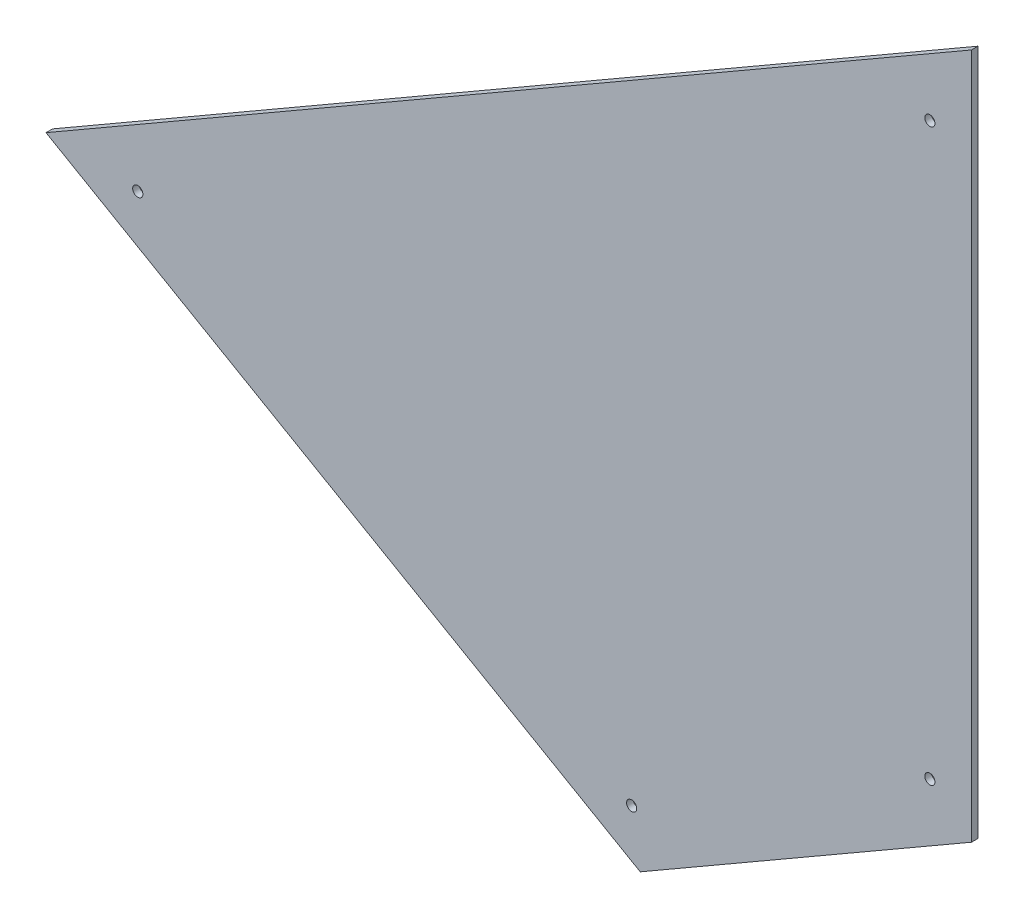
ISO-10303-21;
HEADER;
FILE_DESCRIPTION(('STEP AP214'),'2;1');
FILE_NAME('part.step','',(''),(''),'','','');
FILE_SCHEMA(('AUTOMOTIVE_DESIGN { 1 0 10303 214 1 1 1 1 }'));
ENDSEC;
DATA;
#1=APPLICATION_CONTEXT('core data for automotive mechanical design processes');
#2=APPLICATION_PROTOCOL_DEFINITION('international standard','automotive_design',2000,#1);
#3=PRODUCT_CONTEXT('',#1,'mechanical');
#4=PRODUCT('Part','Part','',(#3));
#5=PRODUCT_RELATED_PRODUCT_CATEGORY('part','',(#4));
#6=PRODUCT_DEFINITION_FORMATION('','',#4);
#7=PRODUCT_DEFINITION_CONTEXT('part definition',#1,'design');
#8=PRODUCT_DEFINITION('design','',#6,#7);
#9=PRODUCT_DEFINITION_SHAPE('','',#8);
#10=(LENGTH_UNIT() NAMED_UNIT(*) SI_UNIT(.MILLI.,.METRE.));
#11=(NAMED_UNIT(*) PLANE_ANGLE_UNIT() SI_UNIT($,.RADIAN.));
#12=(NAMED_UNIT(*) SI_UNIT($,.STERADIAN.) SOLID_ANGLE_UNIT());
#13=UNCERTAINTY_MEASURE_WITH_UNIT(LENGTH_MEASURE(1.E-05),#10,'distance_accuracy_value','');
#14=(GEOMETRIC_REPRESENTATION_CONTEXT(3) GLOBAL_UNCERTAINTY_ASSIGNED_CONTEXT((#13)) GLOBAL_UNIT_ASSIGNED_CONTEXT((#10,
#11,#12)) REPRESENTATION_CONTEXT('',''));
#15=CARTESIAN_POINT('',(0.,0.,0.));
#16=DIRECTION('',(0.,0.,1.));
#17=DIRECTION('',(1.,0.,0.));
#18=AXIS2_PLACEMENT_3D('',#15,#16,#17);
#19=CARTESIAN_POINT('',(0.,0.,2.));
#20=DIRECTION('',(-1.,0.,0.));
#21=DIRECTION('',(0.,-1.,0.));
#22=AXIS2_PLACEMENT_3D('',#19,#20,#21);
#23=PLANE('',#22);
#24=DIRECTION('',(0.,1.,0.));
#25=VECTOR('',#24,1.);
#26=CARTESIAN_POINT('',(0.,0.,0.));
#27=LINE('',#26,#25);
#28=CARTESIAN_POINT('',(4.16333634234434E-12,-209.317404070277,0.));
#29=VERTEX_POINT('',#28);
#30=CARTESIAN_POINT('',(0.,0.,0.));
#31=VERTEX_POINT('',#30);
#32=EDGE_CURVE('E96',#29,#31,#27,.T.);
#33=ORIENTED_EDGE('',*,*,#32,.T.);
#34=DIRECTION('',(0.,0.,-1.));
#35=VECTOR('',#34,1.);
#36=CARTESIAN_POINT('',(0.,0.,2.));
#37=LINE('',#36,#35);
#38=CARTESIAN_POINT('',(0.,0.,2.));
#39=VERTEX_POINT('',#38);
#40=EDGE_CURVE('E11',#39,#31,#37,.T.);
#41=ORIENTED_EDGE('',*,*,#40,.F.);
#42=DIRECTION('',(0.,1.,0.));
#43=VECTOR('',#42,1.);
#44=CARTESIAN_POINT('',(0.,0.,2.));
#45=LINE('',#44,#43);
#46=CARTESIAN_POINT('',(4.16333634234434E-12,-209.317404070277,2.));
#47=VERTEX_POINT('',#46);
#48=EDGE_CURVE('E84',#47,#39,#45,.T.);
#49=ORIENTED_EDGE('',*,*,#48,.F.);
#50=DIRECTION('',(0.,0.,-1.));
#51=VECTOR('',#50,1.);
#52=CARTESIAN_POINT('',(4.16333634234434E-12,-209.317404070277,2.));
#53=LINE('',#52,#51);
#54=EDGE_CURVE('E92',#47,#29,#53,.T.);
#55=ORIENTED_EDGE('',*,*,#54,.T.);
#56=EDGE_LOOP('',(#33,#41,#49,#55));
#57=FACE_BOUND('',#56,.T.);
#58=ADVANCED_FACE('F33',(#57),#23,.F.);
#59=CARTESIAN_POINT('',(-282.318078777815,-163.010743189533,2.));
#60=DIRECTION('',(0.500032954569118,-0.866006376619063,0.));
#61=DIRECTION('',(0.866006376619063,0.500032954569117,0.));
#62=AXIS2_PLACEMENT_3D('',#59,#60,#61);
#63=PLANE('',#62);
#64=DIRECTION('',(-0.866006376619063,-0.500032954569117,0.));
#65=VECTOR('',#64,1.);
#66=CARTESIAN_POINT('',(-282.318078777815,-163.010743189533,0.));
#67=LINE('',#66,#65);
#68=CARTESIAN_POINT('',(-282.318078777815,-163.010743189533,0.));
#69=VERTEX_POINT('',#68);
#70=EDGE_CURVE('E88',#31,#69,#67,.T.);
#71=ORIENTED_EDGE('',*,*,#70,.T.);
#72=DIRECTION('',(0.,0.,-1.));
#73=VECTOR('',#72,1.);
#74=CARTESIAN_POINT('',(-282.318078777815,-163.010743189533,2.));
#75=LINE('',#74,#73);
#76=CARTESIAN_POINT('',(-282.318078777815,-163.010743189533,2.));
#77=VERTEX_POINT('',#76);
#78=EDGE_CURVE('E41',#77,#69,#75,.T.);
#79=ORIENTED_EDGE('',*,*,#78,.F.);
#80=DIRECTION('',(-0.866006376619063,-0.500032954569117,0.));
#81=VECTOR('',#80,1.);
#82=CARTESIAN_POINT('',(-282.318078777815,-163.010743189533,2.));
#83=LINE('',#82,#81);
#84=EDGE_CURVE('E79',#39,#77,#83,.T.);
#85=ORIENTED_EDGE('',*,*,#84,.F.);
#86=ORIENTED_EDGE('',*,*,#40,.T.);
#87=EDGE_LOOP('',(#71,#79,#85,#86));
#88=FACE_BOUND('',#87,.T.);
#89=ADVANCED_FACE('F87',(#88),#63,.F.);
#90=CARTESIAN_POINT('',(-101.035924752496,-267.655648840311,2.));
#91=DIRECTION('',(0.49993408868975,0.866063454353057,0.));
#92=DIRECTION('',(-0.866063454353057,0.49993408868975,0.));
#93=AXIS2_PLACEMENT_3D('',#90,#91,#92);
#94=PLANE('',#93);
#95=DIRECTION('',(0.866063454353056,-0.49993408868975,0.));
#96=VECTOR('',#95,1.);
#97=CARTESIAN_POINT('',(-101.035924752496,-267.655648840311,0.));
#98=LINE('',#97,#96);
#99=CARTESIAN_POINT('',(-101.035924752496,-267.655648840311,0.));
#100=VERTEX_POINT('',#99);
#101=EDGE_CURVE('E66',#69,#100,#98,.T.);
#102=ORIENTED_EDGE('',*,*,#101,.T.);
#103=DIRECTION('',(0.,0.,-1.));
#104=VECTOR('',#103,1.);
#105=CARTESIAN_POINT('',(-101.035924752496,-267.655648840311,2.));
#106=LINE('',#105,#104);
#107=CARTESIAN_POINT('',(-101.035924752496,-267.655648840311,2.));
#108=VERTEX_POINT('',#107);
#109=EDGE_CURVE('E89',#108,#100,#106,.T.);
#110=ORIENTED_EDGE('',*,*,#109,.F.);
#111=DIRECTION('',(0.866063454353056,-0.49993408868975,0.));
#112=VECTOR('',#111,1.);
#113=CARTESIAN_POINT('',(-101.035924752496,-267.655648840311,2.));
#114=LINE('',#113,#112);
#115=EDGE_CURVE('E82',#77,#108,#114,.T.);
#116=ORIENTED_EDGE('',*,*,#115,.F.);
#117=ORIENTED_EDGE('',*,*,#78,.T.);
#118=EDGE_LOOP('',(#102,#110,#116,#117));
#119=FACE_BOUND('',#118,.T.);
#120=ADVANCED_FACE('F90',(#119),#94,.F.);
#121=CARTESIAN_POINT('',(4.16333634234434E-12,-209.317404070277,2.));
#122=DIRECTION('',(-0.500032954569101,0.866006376619073,0.));
#123=DIRECTION('',(-0.866006376619073,-0.500032954569101,0.));
#124=AXIS2_PLACEMENT_3D('',#121,#122,#123);
#125=PLANE('',#124);
#126=DIRECTION('',(0.866006376619073,0.500032954569101,0.));
#127=VECTOR('',#126,1.);
#128=CARTESIAN_POINT('',(4.16333634234434E-12,-209.317404070277,0.));
#129=LINE('',#128,#127);
#130=EDGE_CURVE('E72',#100,#29,#129,.T.);
#131=ORIENTED_EDGE('',*,*,#130,.T.);
#132=ORIENTED_EDGE('',*,*,#54,.F.);
#133=DIRECTION('',(0.866006376619073,0.500032954569101,0.));
#134=VECTOR('',#133,1.);
#135=CARTESIAN_POINT('',(4.16333634234434E-12,-209.317404070277,2.));
#136=LINE('',#135,#134);
#137=EDGE_CURVE('E49',#108,#47,#136,.T.);
#138=ORIENTED_EDGE('',*,*,#137,.F.);
#139=ORIENTED_EDGE('',*,*,#109,.T.);
#140=EDGE_LOOP('',(#131,#132,#138,#139));
#141=FACE_BOUND('',#140,.T.);
#142=ADVANCED_FACE('F104',(#141),#125,.F.);
#143=CARTESIAN_POINT('',(0.,0.,2.));
#144=DIRECTION('',(0.,0.,-1.));
#145=DIRECTION('',(-1.,0.,0.));
#146=AXIS2_PLACEMENT_3D('',#143,#144,#145);
#147=PLANE('',#146);
#148=CARTESIAN_POINT('',(-12.6827160248369,-25.0018478168542,2.));
#149=DIRECTION('',(0.,0.,-1.));
#150=DIRECTION('',(-1.,0.,0.));
#151=AXIS2_PLACEMENT_3D('',#148,#149,#150);
#152=CIRCLE('',#151,1.55);
#153=CARTESIAN_POINT('',(-14.2327160248369,-25.0018478168542,2.));
#154=VERTEX_POINT('',#153);
#155=EDGE_CURVE('E125',#154,#154,#152,.T.);
#156=ORIENTED_EDGE('',*,*,#155,.T.);
#157=EDGE_LOOP('',(#156));
#158=FACE_BOUND('',#157,.T.);
#159=CARTESIAN_POINT('',(-12.6827160248369,-198.961582280666,2.));
#160=DIRECTION('',(0.,0.,-1.));
#161=DIRECTION('',(-1.,0.,0.));
#162=AXIS2_PLACEMENT_3D('',#159,#160,#161);
#163=CIRCLE('',#162,1.54999999999999);
#164=CARTESIAN_POINT('',(-14.2327160248369,-198.961582280666,2.));
#165=VERTEX_POINT('',#164);
#166=EDGE_CURVE('E119',#165,#165,#163,.T.);
#167=ORIENTED_EDGE('',*,*,#166,.T.);
#168=EDGE_LOOP('',(#167));
#169=FACE_BOUND('',#168,.T.);
#170=CARTESIAN_POINT('',(-103.664201466284,-251.494383660239,2.));
#171=DIRECTION('',(0.,0.,-1.));
#172=DIRECTION('',(-1.,0.,0.));
#173=AXIS2_PLACEMENT_3D('',#170,#171,#172);
#174=CIRCLE('',#173,1.55000000000004);
#175=CARTESIAN_POINT('',(-105.214201466284,-251.494383660239,2.));
#176=VERTEX_POINT('',#175);
#177=EDGE_CURVE('E113',#176,#176,#174,.T.);
#178=ORIENTED_EDGE('',*,*,#177,.T.);
#179=EDGE_LOOP('',(#178));
#180=FACE_BOUND('',#179,.T.);
#181=CARTESIAN_POINT('',(-254.324370014353,-164.525982342362,2.));
#182=DIRECTION('',(0.,0.,-1.));
#183=DIRECTION('',(-1.,0.,0.));
#184=AXIS2_PLACEMENT_3D('',#181,#182,#183);
#185=CIRCLE('',#184,1.54999999999999);
#186=CARTESIAN_POINT('',(-255.874370014353,-164.525982342362,2.));
#187=VERTEX_POINT('',#186);
#188=EDGE_CURVE('E99',#187,#187,#185,.T.);
#189=ORIENTED_EDGE('',*,*,#188,.T.);
#190=EDGE_LOOP('',(#189));
#191=FACE_BOUND('',#190,.T.);
#192=ORIENTED_EDGE('',*,*,#48,.T.);
#193=ORIENTED_EDGE('',*,*,#84,.T.);
#194=ORIENTED_EDGE('',*,*,#115,.T.);
#195=ORIENTED_EDGE('',*,*,#137,.T.);
#196=EDGE_LOOP('',(#192,#193,#194,#195));
#197=FACE_BOUND('',#196,.T.);
#198=ADVANCED_FACE('F80',(#158,#169,#180,#191,#197),#147,.F.);
#199=CARTESIAN_POINT('',(0.,0.,0.));
#200=DIRECTION('',(0.,0.,-1.));
#201=DIRECTION('',(-1.,0.,0.));
#202=AXIS2_PLACEMENT_3D('',#199,#200,#201);
#203=PLANE('',#202);
#204=CARTESIAN_POINT('',(-12.6827160248369,-25.0018478168542,0.));
#205=DIRECTION('',(0.,0.,-1.));
#206=DIRECTION('',(-1.,0.,0.));
#207=AXIS2_PLACEMENT_3D('',#204,#205,#206);
#208=CIRCLE('',#207,1.55);
#209=CARTESIAN_POINT('',(-14.2327160248369,-25.0018478168542,0.));
#210=VERTEX_POINT('',#209);
#211=EDGE_CURVE('E128',#210,#210,#208,.T.);
#212=ORIENTED_EDGE('',*,*,#211,.F.);
#213=EDGE_LOOP('',(#212));
#214=FACE_BOUND('',#213,.T.);
#215=CARTESIAN_POINT('',(-12.6827160248369,-198.961582280666,0.));
#216=DIRECTION('',(0.,0.,-1.));
#217=DIRECTION('',(-1.,0.,0.));
#218=AXIS2_PLACEMENT_3D('',#215,#216,#217);
#219=CIRCLE('',#218,1.54999999999999);
#220=CARTESIAN_POINT('',(-14.2327160248369,-198.961582280666,0.));
#221=VERTEX_POINT('',#220);
#222=EDGE_CURVE('E122',#221,#221,#219,.T.);
#223=ORIENTED_EDGE('',*,*,#222,.F.);
#224=EDGE_LOOP('',(#223));
#225=FACE_BOUND('',#224,.T.);
#226=CARTESIAN_POINT('',(-103.664201466284,-251.494383660239,0.));
#227=DIRECTION('',(0.,0.,-1.));
#228=DIRECTION('',(-1.,0.,0.));
#229=AXIS2_PLACEMENT_3D('',#226,#227,#228);
#230=CIRCLE('',#229,1.55000000000004);
#231=CARTESIAN_POINT('',(-105.214201466284,-251.494383660239,0.));
#232=VERTEX_POINT('',#231);
#233=EDGE_CURVE('E116',#232,#232,#230,.T.);
#234=ORIENTED_EDGE('',*,*,#233,.F.);
#235=EDGE_LOOP('',(#234));
#236=FACE_BOUND('',#235,.T.);
#237=CARTESIAN_POINT('',(-254.324370014353,-164.525982342362,0.));
#238=DIRECTION('',(0.,0.,-1.));
#239=DIRECTION('',(-1.,0.,0.));
#240=AXIS2_PLACEMENT_3D('',#237,#238,#239);
#241=CIRCLE('',#240,1.54999999999999);
#242=CARTESIAN_POINT('',(-255.874370014353,-164.525982342362,0.));
#243=VERTEX_POINT('',#242);
#244=EDGE_CURVE('E110',#243,#243,#241,.T.);
#245=ORIENTED_EDGE('',*,*,#244,.F.);
#246=EDGE_LOOP('',(#245));
#247=FACE_BOUND('',#246,.T.);
#248=ORIENTED_EDGE('',*,*,#32,.F.);
#249=ORIENTED_EDGE('',*,*,#130,.F.);
#250=ORIENTED_EDGE('',*,*,#101,.F.);
#251=ORIENTED_EDGE('',*,*,#70,.F.);
#252=EDGE_LOOP('',(#248,#249,#250,#251));
#253=FACE_BOUND('',#252,.T.);
#254=ADVANCED_FACE('F107',(#214,#225,#236,#247,#253),#203,.T.);
#255=CARTESIAN_POINT('',(-254.324370014353,-164.525982342362,2.));
#256=DIRECTION('',(0.,0.,-1.));
#257=DIRECTION('',(-1.,0.,0.));
#258=AXIS2_PLACEMENT_3D('',#255,#256,#257);
#259=CYLINDRICAL_SURFACE('',#258,1.54999999999999);
#260=ORIENTED_EDGE('',*,*,#188,.F.);
#261=EDGE_LOOP('',(#260));
#262=FACE_BOUND('',#261,.T.);
#263=ORIENTED_EDGE('',*,*,#244,.T.);
#264=EDGE_LOOP('',(#263));
#265=FACE_BOUND('',#264,.T.);
#266=ADVANCED_FACE('F145',(#262,#265),#259,.F.);
#267=CARTESIAN_POINT('',(-103.664201466284,-251.494383660239,2.));
#268=DIRECTION('',(0.,0.,-1.));
#269=DIRECTION('',(-1.,0.,0.));
#270=AXIS2_PLACEMENT_3D('',#267,#268,#269);
#271=CYLINDRICAL_SURFACE('',#270,1.55000000000004);
#272=ORIENTED_EDGE('',*,*,#177,.F.);
#273=EDGE_LOOP('',(#272));
#274=FACE_BOUND('',#273,.T.);
#275=ORIENTED_EDGE('',*,*,#233,.T.);
#276=EDGE_LOOP('',(#275));
#277=FACE_BOUND('',#276,.T.);
#278=ADVANCED_FACE('F154',(#274,#277),#271,.F.);
#279=CARTESIAN_POINT('',(-12.6827160248369,-198.961582280666,2.));
#280=DIRECTION('',(0.,0.,-1.));
#281=DIRECTION('',(-1.,0.,0.));
#282=AXIS2_PLACEMENT_3D('',#279,#280,#281);
#283=CYLINDRICAL_SURFACE('',#282,1.54999999999999);
#284=ORIENTED_EDGE('',*,*,#166,.F.);
#285=EDGE_LOOP('',(#284));
#286=FACE_BOUND('',#285,.T.);
#287=ORIENTED_EDGE('',*,*,#222,.T.);
#288=EDGE_LOOP('',(#287));
#289=FACE_BOUND('',#288,.T.);
#290=ADVANCED_FACE('F139',(#286,#289),#283,.F.);
#291=CARTESIAN_POINT('',(-12.6827160248369,-25.0018478168542,2.));
#292=DIRECTION('',(0.,0.,-1.));
#293=DIRECTION('',(-1.,0.,0.));
#294=AXIS2_PLACEMENT_3D('',#291,#292,#293);
#295=CYLINDRICAL_SURFACE('',#294,1.55);
#296=ORIENTED_EDGE('',*,*,#155,.F.);
#297=EDGE_LOOP('',(#296));
#298=FACE_BOUND('',#297,.T.);
#299=ORIENTED_EDGE('',*,*,#211,.T.);
#300=EDGE_LOOP('',(#299));
#301=FACE_BOUND('',#300,.T.);
#302=ADVANCED_FACE('F136',(#298,#301),#295,.F.);
#303=CLOSED_SHELL('',(#58,#89,#120,#142,#198,#254,#266,#278,#290,#302));
#304=MANIFOLD_SOLID_BREP('B2',#303);
#305=ADVANCED_BREP_SHAPE_REPRESENTATION('',(#18,#304),#14);
#306=SHAPE_DEFINITION_REPRESENTATION(#9,#305);
ENDSEC;
END-ISO-10303-21;
